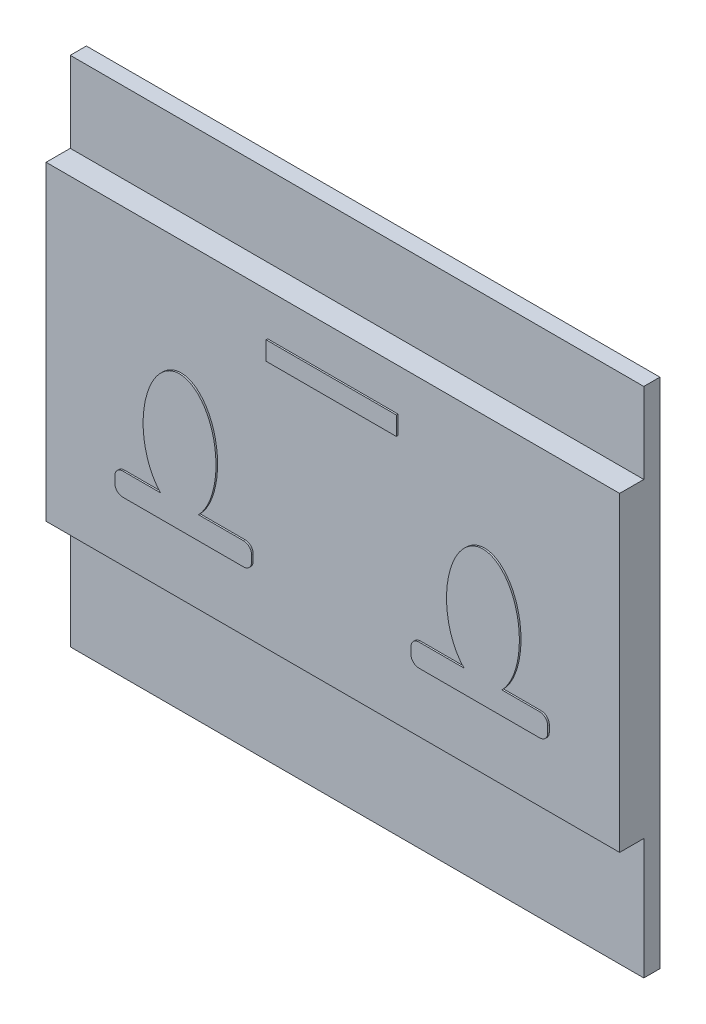
ISO-10303-21;
HEADER;
FILE_DESCRIPTION(('STEP AP214'),'2;1');
FILE_NAME('part.step','',(''),(''),'','','');
FILE_SCHEMA(('AUTOMOTIVE_DESIGN { 1 0 10303 214 1 1 1 1 }'));
ENDSEC;
DATA;
#1=APPLICATION_CONTEXT('core data for automotive mechanical design processes');
#2=APPLICATION_PROTOCOL_DEFINITION('international standard','automotive_design',2000,#1);
#3=PRODUCT_CONTEXT('',#1,'mechanical');
#4=PRODUCT('Part','Part','',(#3));
#5=PRODUCT_RELATED_PRODUCT_CATEGORY('part','',(#4));
#6=PRODUCT_DEFINITION_FORMATION('','',#4);
#7=PRODUCT_DEFINITION_CONTEXT('part definition',#1,'design');
#8=PRODUCT_DEFINITION('design','',#6,#7);
#9=PRODUCT_DEFINITION_SHAPE('','',#8);
#10=(LENGTH_UNIT() NAMED_UNIT(*) SI_UNIT(.MILLI.,.METRE.));
#11=(NAMED_UNIT(*) PLANE_ANGLE_UNIT() SI_UNIT($,.RADIAN.));
#12=(NAMED_UNIT(*) SI_UNIT($,.STERADIAN.) SOLID_ANGLE_UNIT());
#13=UNCERTAINTY_MEASURE_WITH_UNIT(LENGTH_MEASURE(1.E-05),#10,'distance_accuracy_value','');
#14=(GEOMETRIC_REPRESENTATION_CONTEXT(3) GLOBAL_UNCERTAINTY_ASSIGNED_CONTEXT((#13)) GLOBAL_UNIT_ASSIGNED_CONTEXT((#10,
#11,#12)) REPRESENTATION_CONTEXT('',''));
#15=CARTESIAN_POINT('',(0.,0.,0.));
#16=DIRECTION('',(0.,0.,1.));
#17=DIRECTION('',(1.,0.,0.));
#18=AXIS2_PLACEMENT_3D('',#15,#16,#17);
#19=CARTESIAN_POINT('',(0.,0.,2.5));
#20=DIRECTION('',(0.,0.,1.));
#21=DIRECTION('',(1.,0.,0.));
#22=AXIS2_PLACEMENT_3D('',#19,#20,#21);
#23=PLANE('',#22);
#24=DIRECTION('',(-1.,0.,0.));
#25=VECTOR('',#24,1.);
#26=CARTESIAN_POINT('',(-4.04139558605371,8.28616063797973,2.5));
#27=LINE('',#26,#25);
#28=CARTESIAN_POINT('',(4.04139558605371,8.28616063797973,2.5));
#29=VERTEX_POINT('',#28);
#30=CARTESIAN_POINT('',(-4.04139558605371,8.28616063797973,2.5));
#31=VERTEX_POINT('',#30);
#32=EDGE_CURVE('E276',#29,#31,#27,.T.);
#33=ORIENTED_EDGE('',*,*,#32,.F.);
#34=DIRECTION('',(0.,1.,0.));
#35=VECTOR('',#34,1.);
#36=CARTESIAN_POINT('',(4.04139558605371,8.28616063797973,2.5));
#37=LINE('',#36,#35);
#38=CARTESIAN_POINT('',(4.04139558605371,7.13085222622603,2.5));
#39=VERTEX_POINT('',#38);
#40=EDGE_CURVE('E273',#39,#29,#37,.T.);
#41=ORIENTED_EDGE('',*,*,#40,.F.);
#42=DIRECTION('',(1.,0.,0.));
#43=VECTOR('',#42,1.);
#44=CARTESIAN_POINT('',(-4.04139558605371,7.13085222622603,2.5));
#45=LINE('',#44,#43);
#46=CARTESIAN_POINT('',(-4.04139558605371,7.13085222622603,2.5));
#47=VERTEX_POINT('',#46);
#48=EDGE_CURVE('E286',#47,#39,#45,.T.);
#49=ORIENTED_EDGE('',*,*,#48,.F.);
#50=DIRECTION('',(0.,-1.,0.));
#51=VECTOR('',#50,1.);
#52=CARTESIAN_POINT('',(-4.04139558605371,8.28616063797973,2.5));
#53=LINE('',#52,#51);
#54=EDGE_CURVE('E294',#31,#47,#53,.T.);
#55=ORIENTED_EDGE('',*,*,#54,.F.);
#56=EDGE_LOOP('',(#33,#41,#49,#55));
#57=FACE_BOUND('',#56,.T.);
#58=DIRECTION('',(0.,1.,0.));
#59=VECTOR('',#58,1.);
#60=CARTESIAN_POINT('',(17.8,10.9,2.5));
#61=LINE('',#60,#59);
#62=CARTESIAN_POINT('',(17.8,-8.4,2.5));
#63=VERTEX_POINT('',#62);
#64=CARTESIAN_POINT('',(17.8,10.9,2.5));
#65=VERTEX_POINT('',#64);
#66=EDGE_CURVE('E456',#63,#65,#61,.T.);
#67=ORIENTED_EDGE('',*,*,#66,.T.);
#68=DIRECTION('',(-1.,0.,0.));
#69=VECTOR('',#68,1.);
#70=CARTESIAN_POINT('',(-17.8,10.9,2.5));
#71=LINE('',#70,#69);
#72=CARTESIAN_POINT('',(-17.8,10.9,2.5));
#73=VERTEX_POINT('',#72);
#74=EDGE_CURVE('E469',#65,#73,#71,.T.);
#75=ORIENTED_EDGE('',*,*,#74,.T.);
#76=DIRECTION('',(0.,-1.,0.));
#77=VECTOR('',#76,1.);
#78=CARTESIAN_POINT('',(-17.8,10.9,2.5));
#79=LINE('',#78,#77);
#80=CARTESIAN_POINT('',(-17.8,-8.4,2.5));
#81=VERTEX_POINT('',#80);
#82=EDGE_CURVE('E467',#73,#81,#79,.T.);
#83=ORIENTED_EDGE('',*,*,#82,.T.);
#84=DIRECTION('',(1.,0.,0.));
#85=VECTOR('',#84,1.);
#86=CARTESIAN_POINT('',(-17.8,-8.4,2.5));
#87=LINE('',#86,#85);
#88=EDGE_CURVE('E464',#81,#63,#87,.T.);
#89=ORIENTED_EDGE('',*,*,#88,.T.);
#90=EDGE_LOOP('',(#67,#75,#83,#89));
#91=FACE_BOUND('',#90,.T.);
#92=DIRECTION('',(1.,0.,0.));
#93=VECTOR('',#92,1.);
#94=CARTESIAN_POINT('',(12.9345552815516,-4.6231550932699,2.5));
#95=LINE('',#94,#93);
#96=CARTESIAN_POINT('',(5.44554999524602,-4.6231550932699,2.5));
#97=VERTEX_POINT('',#96);
#98=CARTESIAN_POINT('',(12.9345552815516,-4.6231550932699,2.5));
#99=VERTEX_POINT('',#98);
#100=EDGE_CURVE('E515',#97,#99,#95,.T.);
#101=ORIENTED_EDGE('',*,*,#100,.F.);
#102=CARTESIAN_POINT('',(5.44554999524602,-4.1231550932699,2.5));
#103=DIRECTION('',(0.,0.,1.));
#104=DIRECTION('',(1.,0.,0.));
#105=AXIS2_PLACEMENT_3D('',#102,#103,#104);
#106=CIRCLE('',#105,0.5);
#107=CARTESIAN_POINT('',(4.94554999524602,-4.12315509326989,2.5));
#108=VERTEX_POINT('',#107);
#109=EDGE_CURVE('E305',#108,#97,#106,.T.);
#110=ORIENTED_EDGE('',*,*,#109,.F.);
#111=DIRECTION('',(0.,-1.,0.));
#112=VECTOR('',#111,1.);
#113=CARTESIAN_POINT('',(4.94554999524602,-4.12315509326989,2.5));
#114=LINE('',#113,#112);
#115=CARTESIAN_POINT('',(4.94554999524602,-3.71669267897525,2.5));
#116=VERTEX_POINT('',#115);
#117=EDGE_CURVE('E310',#116,#108,#114,.T.);
#118=ORIENTED_EDGE('',*,*,#117,.F.);
#119=CARTESIAN_POINT('',(5.44554999524602,-3.71669267897525,2.5));
#120=DIRECTION('',(0.,0.,1.));
#121=DIRECTION('',(-1.,0.,0.));
#122=AXIS2_PLACEMENT_3D('',#119,#120,#121);
#123=CIRCLE('',#122,0.5);
#124=CARTESIAN_POINT('',(5.44554999524602,-3.21669267897525,2.5));
#125=VERTEX_POINT('',#124);
#126=EDGE_CURVE('E500',#125,#116,#123,.T.);
#127=ORIENTED_EDGE('',*,*,#126,.F.);
#128=DIRECTION('',(-1.,0.,0.));
#129=VECTOR('',#128,1.);
#130=CARTESIAN_POINT('',(8.23788008970894,-3.21669267897525,2.5));
#131=LINE('',#130,#129);
#132=CARTESIAN_POINT('',(8.23788008970894,-3.21669267897525,2.5));
#133=VERTEX_POINT('',#132);
#134=EDGE_CURVE('E503',#133,#125,#131,.T.);
#135=ORIENTED_EDGE('',*,*,#134,.F.);
#136=CARTESIAN_POINT('',(9.41609124069688,0.,2.5));
#137=DIRECTION('',(0.,0.,1.));
#138=DIRECTION('',(0.,-1.,0.));
#139=AXIS2_PLACEMENT_3D('',#136,#137,#138);
#140=ELLIPSE('',#139,3.76923148459659,2.26038602298075);
#141=CARTESIAN_POINT('',(10.5943023916848,-3.21669267897525,2.5));
#142=VERTEX_POINT('',#141);
#143=EDGE_CURVE('E505',#142,#133,#140,.T.);
#144=ORIENTED_EDGE('',*,*,#143,.F.);
#145=DIRECTION('',(-1.,0.,0.));
#146=VECTOR('',#145,1.);
#147=CARTESIAN_POINT('',(12.9345552815516,-3.21669267897525,2.5));
#148=LINE('',#147,#146);
#149=CARTESIAN_POINT('',(12.9345552815516,-3.21669267897525,2.5));
#150=VERTEX_POINT('',#149);
#151=EDGE_CURVE('E507',#150,#142,#148,.T.);
#152=ORIENTED_EDGE('',*,*,#151,.F.);
#153=CARTESIAN_POINT('',(12.9345552815516,-3.71669267897525,2.5));
#154=DIRECTION('',(0.,0.,1.));
#155=DIRECTION('',(-1.,0.,0.));
#156=AXIS2_PLACEMENT_3D('',#153,#154,#155);
#157=CIRCLE('',#156,0.5);
#158=CARTESIAN_POINT('',(13.4345552815516,-3.71669267897525,2.5));
#159=VERTEX_POINT('',#158);
#160=EDGE_CURVE('E509',#159,#150,#157,.T.);
#161=ORIENTED_EDGE('',*,*,#160,.F.);
#162=DIRECTION('',(0.,1.,0.));
#163=VECTOR('',#162,1.);
#164=CARTESIAN_POINT('',(13.4345552815516,-4.12315509326989,2.5));
#165=LINE('',#164,#163);
#166=CARTESIAN_POINT('',(13.4345552815516,-4.12315509326989,2.5));
#167=VERTEX_POINT('',#166);
#168=EDGE_CURVE('E511',#167,#159,#165,.T.);
#169=ORIENTED_EDGE('',*,*,#168,.F.);
#170=CARTESIAN_POINT('',(12.9345552815516,-4.1231550932699,2.5));
#171=DIRECTION('',(0.,0.,1.));
#172=DIRECTION('',(-1.,0.,0.));
#173=AXIS2_PLACEMENT_3D('',#170,#171,#172);
#174=CIRCLE('',#173,0.5);
#175=EDGE_CURVE('E513',#99,#167,#174,.T.);
#176=ORIENTED_EDGE('',*,*,#175,.F.);
#177=EDGE_LOOP('',(#101,#110,#118,#127,#135,#144,#152,#161,#169,#176));
#178=FACE_BOUND('',#177,.T.);
#179=DIRECTION('',(-1.,0.,0.));
#180=VECTOR('',#179,1.);
#181=CARTESIAN_POINT('',(-12.9345552815516,-3.21669267897525,2.5));
#182=LINE('',#181,#180);
#183=CARTESIAN_POINT('',(-10.5943023916848,-3.21669267897525,2.5));
#184=VERTEX_POINT('',#183);
#185=CARTESIAN_POINT('',(-12.9345552815516,-3.21669267897525,2.5));
#186=VERTEX_POINT('',#185);
#187=EDGE_CURVE('E559',#184,#186,#182,.T.);
#188=ORIENTED_EDGE('',*,*,#187,.F.);
#189=CARTESIAN_POINT('',(-9.41609124069688,0.,2.5));
#190=DIRECTION('',(0.,0.,1.));
#191=DIRECTION('',(0.,-1.,0.));
#192=AXIS2_PLACEMENT_3D('',#189,#190,#191);
#193=ELLIPSE('',#192,3.76923148459659,2.26038602298075);
#194=CARTESIAN_POINT('',(-8.23788008970894,-3.21669267897525,2.5));
#195=VERTEX_POINT('',#194);
#196=EDGE_CURVE('E271',#195,#184,#193,.T.);
#197=ORIENTED_EDGE('',*,*,#196,.F.);
#198=DIRECTION('',(-1.,0.,0.));
#199=VECTOR('',#198,1.);
#200=CARTESIAN_POINT('',(-8.23788008970894,-3.21669267897525,2.5));
#201=LINE('',#200,#199);
#202=CARTESIAN_POINT('',(-5.44554999524602,-3.21669267897525,2.5));
#203=VERTEX_POINT('',#202);
#204=EDGE_CURVE('E267',#203,#195,#201,.T.);
#205=ORIENTED_EDGE('',*,*,#204,.F.);
#206=CARTESIAN_POINT('',(-5.44554999524602,-3.71669267897525,2.5));
#207=DIRECTION('',(0.,0.,1.));
#208=DIRECTION('',(1.,0.,0.));
#209=AXIS2_PLACEMENT_3D('',#206,#207,#208);
#210=CIRCLE('',#209,0.5);
#211=CARTESIAN_POINT('',(-4.94554999524602,-3.71669267897525,2.5));
#212=VERTEX_POINT('',#211);
#213=EDGE_CURVE('E578',#212,#203,#210,.T.);
#214=ORIENTED_EDGE('',*,*,#213,.F.);
#215=DIRECTION('',(0.,1.,0.));
#216=VECTOR('',#215,1.);
#217=CARTESIAN_POINT('',(-4.94554999524602,-4.12315509326989,2.5));
#218=LINE('',#217,#216);
#219=CARTESIAN_POINT('',(-4.94554999524602,-4.12315509326989,2.5));
#220=VERTEX_POINT('',#219);
#221=EDGE_CURVE('E576',#220,#212,#218,.T.);
#222=ORIENTED_EDGE('',*,*,#221,.F.);
#223=CARTESIAN_POINT('',(-5.44554999524602,-4.1231550932699,2.5));
#224=DIRECTION('',(0.,0.,1.));
#225=DIRECTION('',(-1.,0.,0.));
#226=AXIS2_PLACEMENT_3D('',#223,#224,#225);
#227=CIRCLE('',#226,0.5);
#228=CARTESIAN_POINT('',(-5.44554999524602,-4.6231550932699,2.5));
#229=VERTEX_POINT('',#228);
#230=EDGE_CURVE('E574',#229,#220,#227,.T.);
#231=ORIENTED_EDGE('',*,*,#230,.F.);
#232=DIRECTION('',(1.,0.,0.));
#233=VECTOR('',#232,1.);
#234=CARTESIAN_POINT('',(-12.9345552815516,-4.6231550932699,2.5));
#235=LINE('',#234,#233);
#236=CARTESIAN_POINT('',(-12.9345552815516,-4.6231550932699,2.5));
#237=VERTEX_POINT('',#236);
#238=EDGE_CURVE('E572',#237,#229,#235,.T.);
#239=ORIENTED_EDGE('',*,*,#238,.F.);
#240=CARTESIAN_POINT('',(-12.9345552815516,-4.1231550932699,2.5));
#241=DIRECTION('',(0.,0.,1.));
#242=DIRECTION('',(1.,0.,0.));
#243=AXIS2_PLACEMENT_3D('',#240,#241,#242);
#244=CIRCLE('',#243,0.5);
#245=CARTESIAN_POINT('',(-13.4345552815516,-4.12315509326989,2.5));
#246=VERTEX_POINT('',#245);
#247=EDGE_CURVE('E570',#246,#237,#244,.T.);
#248=ORIENTED_EDGE('',*,*,#247,.F.);
#249=DIRECTION('',(0.,-1.,0.));
#250=VECTOR('',#249,1.);
#251=CARTESIAN_POINT('',(-13.4345552815516,-4.12315509326989,2.5));
#252=LINE('',#251,#250);
#253=CARTESIAN_POINT('',(-13.4345552815516,-3.71669267897525,2.5));
#254=VERTEX_POINT('',#253);
#255=EDGE_CURVE('E564',#254,#246,#252,.T.);
#256=ORIENTED_EDGE('',*,*,#255,.F.);
#257=CARTESIAN_POINT('',(-12.9345552815516,-3.71669267897525,2.5));
#258=DIRECTION('',(0.,0.,1.));
#259=DIRECTION('',(1.,0.,0.));
#260=AXIS2_PLACEMENT_3D('',#257,#258,#259);
#261=CIRCLE('',#260,0.5);
#262=EDGE_CURVE('E562',#186,#254,#261,.T.);
#263=ORIENTED_EDGE('',*,*,#262,.F.);
#264=EDGE_LOOP('',(#188,#197,#205,#214,#222,#231,#239,#248,#256,#263));
#265=FACE_BOUND('',#264,.T.);
#266=ADVANCED_FACE('F36',(#57,#91,#178,#265),#23,.T.);
#267=CARTESIAN_POINT('',(0.,0.,1.));
#268=DIRECTION('',(0.,0.,-1.));
#269=DIRECTION('',(-1.,0.,0.));
#270=AXIS2_PLACEMENT_3D('',#267,#268,#269);
#271=PLANE('',#270);
#272=DIRECTION('',(1.,0.,0.));
#273=VECTOR('',#272,1.);
#274=CARTESIAN_POINT('',(-17.8,-8.4,1.));
#275=LINE('',#274,#273);
#276=CARTESIAN_POINT('',(-17.8,-8.4,1.));
#277=VERTEX_POINT('',#276);
#278=CARTESIAN_POINT('',(17.8,-8.4,1.));
#279=VERTEX_POINT('',#278);
#280=EDGE_CURVE('E454',#277,#279,#275,.T.);
#281=ORIENTED_EDGE('',*,*,#280,.F.);
#282=DIRECTION('',(0.,-1.,0.));
#283=VECTOR('',#282,1.);
#284=CARTESIAN_POINT('',(-17.8,15.9,1.));
#285=LINE('',#284,#283);
#286=CARTESIAN_POINT('',(-17.8,-15.9,1.));
#287=VERTEX_POINT('',#286);
#288=EDGE_CURVE('E412',#277,#287,#285,.T.);
#289=ORIENTED_EDGE('',*,*,#288,.T.);
#290=DIRECTION('',(1.,0.,0.));
#291=VECTOR('',#290,1.);
#292=CARTESIAN_POINT('',(17.8,-15.9,1.));
#293=LINE('',#292,#291);
#294=CARTESIAN_POINT('',(17.8,-15.9,1.));
#295=VERTEX_POINT('',#294);
#296=EDGE_CURVE('E424',#287,#295,#293,.T.);
#297=ORIENTED_EDGE('',*,*,#296,.T.);
#298=DIRECTION('',(0.,1.,0.));
#299=VECTOR('',#298,1.);
#300=CARTESIAN_POINT('',(17.8,15.9,1.));
#301=LINE('',#300,#299);
#302=EDGE_CURVE('E406',#295,#279,#301,.T.);
#303=ORIENTED_EDGE('',*,*,#302,.T.);
#304=EDGE_LOOP('',(#281,#289,#297,#303));
#305=FACE_BOUND('',#304,.T.);
#306=ADVANCED_FACE('F360',(#305),#271,.F.);
#307=DIRECTION('',(-1.,0.,0.));
#308=VECTOR('',#307,1.);
#309=CARTESIAN_POINT('',(-17.8,10.9,1.));
#310=LINE('',#309,#308);
#311=CARTESIAN_POINT('',(17.8,10.9,1.));
#312=VERTEX_POINT('',#311);
#313=CARTESIAN_POINT('',(-17.8,10.9,1.));
#314=VERTEX_POINT('',#313);
#315=EDGE_CURVE('E445',#312,#314,#310,.T.);
#316=ORIENTED_EDGE('',*,*,#315,.F.);
#317=CARTESIAN_POINT('',(17.8,15.9,1.));
#318=VERTEX_POINT('',#317);
#319=EDGE_CURVE('E433',#312,#318,#301,.T.);
#320=ORIENTED_EDGE('',*,*,#319,.T.);
#321=DIRECTION('',(-1.,0.,0.));
#322=VECTOR('',#321,1.);
#323=CARTESIAN_POINT('',(17.8,15.9,1.));
#324=LINE('',#323,#322);
#325=CARTESIAN_POINT('',(-17.8,15.9,1.));
#326=VERTEX_POINT('',#325);
#327=EDGE_CURVE('E419',#318,#326,#324,.T.);
#328=ORIENTED_EDGE('',*,*,#327,.T.);
#329=EDGE_CURVE('E421',#326,#314,#285,.T.);
#330=ORIENTED_EDGE('',*,*,#329,.T.);
#331=EDGE_LOOP('',(#316,#320,#328,#330));
#332=FACE_BOUND('',#331,.T.);
#333=ADVANCED_FACE('F372',(#332),#271,.F.);
#334=CARTESIAN_POINT('',(-17.8,15.9,1.));
#335=DIRECTION('',(1.,0.,0.));
#336=DIRECTION('',(0.,1.,0.));
#337=AXIS2_PLACEMENT_3D('',#334,#335,#336);
#338=PLANE('',#337);
#339=DIRECTION('',(0.,-1.,0.));
#340=VECTOR('',#339,1.);
#341=CARTESIAN_POINT('',(-17.8,15.9,0.));
#342=LINE('',#341,#340);
#343=CARTESIAN_POINT('',(-17.8,15.9,0.));
#344=VERTEX_POINT('',#343);
#345=CARTESIAN_POINT('',(-17.8,-15.9,0.));
#346=VERTEX_POINT('',#345);
#347=EDGE_CURVE('E401',#344,#346,#342,.T.);
#348=ORIENTED_EDGE('',*,*,#347,.T.);
#349=DIRECTION('',(0.,0.,-1.));
#350=VECTOR('',#349,1.);
#351=CARTESIAN_POINT('',(-17.8,-15.9,1.));
#352=LINE('',#351,#350);
#353=EDGE_CURVE('E11',#287,#346,#352,.T.);
#354=ORIENTED_EDGE('',*,*,#353,.F.);
#355=ORIENTED_EDGE('',*,*,#288,.F.);
#356=DIRECTION('',(0.,0.,-1.));
#357=VECTOR('',#356,1.);
#358=CARTESIAN_POINT('',(-17.8,-8.4,2.5));
#359=LINE('',#358,#357);
#360=EDGE_CURVE('E939',#81,#277,#359,.T.);
#361=ORIENTED_EDGE('',*,*,#360,.F.);
#362=ORIENTED_EDGE('',*,*,#82,.F.);
#363=DIRECTION('',(0.,0.,-1.));
#364=VECTOR('',#363,1.);
#365=CARTESIAN_POINT('',(-17.8,10.9,2.5));
#366=LINE('',#365,#364);
#367=EDGE_CURVE('E452',#73,#314,#366,.T.);
#368=ORIENTED_EDGE('',*,*,#367,.T.);
#369=ORIENTED_EDGE('',*,*,#329,.F.);
#370=DIRECTION('',(0.,0.,-1.));
#371=VECTOR('',#370,1.);
#372=CARTESIAN_POINT('',(-17.8,15.9,1.));
#373=LINE('',#372,#371);
#374=EDGE_CURVE('E416',#326,#344,#373,.T.);
#375=ORIENTED_EDGE('',*,*,#374,.T.);
#376=EDGE_LOOP('',(#348,#354,#355,#361,#362,#368,#369,#375));
#377=FACE_BOUND('',#376,.T.);
#378=ADVANCED_FACE('F38',(#377),#338,.F.);
#379=CARTESIAN_POINT('',(17.8,-15.9,1.));
#380=DIRECTION('',(0.,1.,0.));
#381=DIRECTION('',(-1.,0.,0.));
#382=AXIS2_PLACEMENT_3D('',#379,#380,#381);
#383=PLANE('',#382);
#384=DIRECTION('',(1.,0.,0.));
#385=VECTOR('',#384,1.);
#386=CARTESIAN_POINT('',(17.8,-15.9,0.));
#387=LINE('',#386,#385);
#388=CARTESIAN_POINT('',(17.8,-15.9,0.));
#389=VERTEX_POINT('',#388);
#390=EDGE_CURVE('E392',#346,#389,#387,.T.);
#391=ORIENTED_EDGE('',*,*,#390,.T.);
#392=DIRECTION('',(0.,0.,-1.));
#393=VECTOR('',#392,1.);
#394=CARTESIAN_POINT('',(17.8,-15.9,1.));
#395=LINE('',#394,#393);
#396=EDGE_CURVE('E45',#295,#389,#395,.T.);
#397=ORIENTED_EDGE('',*,*,#396,.F.);
#398=ORIENTED_EDGE('',*,*,#296,.F.);
#399=ORIENTED_EDGE('',*,*,#353,.T.);
#400=EDGE_LOOP('',(#391,#397,#398,#399));
#401=FACE_BOUND('',#400,.T.);
#402=ADVANCED_FACE('F383',(#401),#383,.F.);
#403=CARTESIAN_POINT('',(17.8,15.9,1.));
#404=DIRECTION('',(-1.,0.,0.));
#405=DIRECTION('',(0.,-1.,0.));
#406=AXIS2_PLACEMENT_3D('',#403,#404,#405);
#407=PLANE('',#406);
#408=DIRECTION('',(0.,1.,0.));
#409=VECTOR('',#408,1.);
#410=CARTESIAN_POINT('',(17.8,15.9,0.));
#411=LINE('',#410,#409);
#412=CARTESIAN_POINT('',(17.8,15.9,0.));
#413=VERTEX_POINT('',#412);
#414=EDGE_CURVE('E400',#389,#413,#411,.T.);
#415=ORIENTED_EDGE('',*,*,#414,.T.);
#416=DIRECTION('',(0.,0.,-1.));
#417=VECTOR('',#416,1.);
#418=CARTESIAN_POINT('',(17.8,15.9,1.));
#419=LINE('',#418,#417);
#420=EDGE_CURVE('E407',#318,#413,#419,.T.);
#421=ORIENTED_EDGE('',*,*,#420,.F.);
#422=ORIENTED_EDGE('',*,*,#319,.F.);
#423=DIRECTION('',(0.,0.,-1.));
#424=VECTOR('',#423,1.);
#425=CARTESIAN_POINT('',(17.8,10.9,2.5));
#426=LINE('',#425,#424);
#427=EDGE_CURVE('E453',#65,#312,#426,.T.);
#428=ORIENTED_EDGE('',*,*,#427,.F.);
#429=ORIENTED_EDGE('',*,*,#66,.F.);
#430=DIRECTION('',(0.,0.,-1.));
#431=VECTOR('',#430,1.);
#432=CARTESIAN_POINT('',(17.8,-8.4,2.5));
#433=LINE('',#432,#431);
#434=EDGE_CURVE('E466',#63,#279,#433,.T.);
#435=ORIENTED_EDGE('',*,*,#434,.T.);
#436=ORIENTED_EDGE('',*,*,#302,.F.);
#437=ORIENTED_EDGE('',*,*,#396,.T.);
#438=EDGE_LOOP('',(#415,#421,#422,#428,#429,#435,#436,#437));
#439=FACE_BOUND('',#438,.T.);
#440=ADVANCED_FACE('F380',(#439),#407,.F.);
#441=CARTESIAN_POINT('',(17.8,15.9,1.));
#442=DIRECTION('',(0.,-1.,0.));
#443=DIRECTION('',(0.,0.,-1.));
#444=AXIS2_PLACEMENT_3D('',#441,#442,#443);
#445=PLANE('',#444);
#446=DIRECTION('',(-1.,0.,0.));
#447=VECTOR('',#446,1.);
#448=CARTESIAN_POINT('',(17.8,15.9,0.));
#449=LINE('',#448,#447);
#450=EDGE_CURVE('E410',#413,#344,#449,.T.);
#451=ORIENTED_EDGE('',*,*,#450,.T.);
#452=ORIENTED_EDGE('',*,*,#374,.F.);
#453=ORIENTED_EDGE('',*,*,#327,.F.);
#454=ORIENTED_EDGE('',*,*,#420,.T.);
#455=EDGE_LOOP('',(#451,#452,#453,#454));
#456=FACE_BOUND('',#455,.T.);
#457=ADVANCED_FACE('F376',(#456),#445,.F.);
#458=CARTESIAN_POINT('',(0.,0.,0.));
#459=DIRECTION('',(0.,0.,-1.));
#460=DIRECTION('',(-1.,0.,0.));
#461=AXIS2_PLACEMENT_3D('',#458,#459,#460);
#462=PLANE('',#461);
#463=ORIENTED_EDGE('',*,*,#347,.F.);
#464=ORIENTED_EDGE('',*,*,#450,.F.);
#465=ORIENTED_EDGE('',*,*,#414,.F.);
#466=ORIENTED_EDGE('',*,*,#390,.F.);
#467=EDGE_LOOP('',(#463,#464,#465,#466));
#468=FACE_BOUND('',#467,.T.);
#469=ADVANCED_FACE('F368',(#468),#462,.T.);
#470=CARTESIAN_POINT('',(-17.8,10.9,2.5));
#471=DIRECTION('',(0.,-1.,0.));
#472=DIRECTION('',(0.,0.,-1.));
#473=AXIS2_PLACEMENT_3D('',#470,#471,#472);
#474=PLANE('',#473);
#475=ORIENTED_EDGE('',*,*,#315,.T.);
#476=ORIENTED_EDGE('',*,*,#367,.F.);
#477=ORIENTED_EDGE('',*,*,#74,.F.);
#478=ORIENTED_EDGE('',*,*,#427,.T.);
#479=EDGE_LOOP('',(#475,#476,#477,#478));
#480=FACE_BOUND('',#479,.T.);
#481=ADVANCED_FACE('F364',(#480),#474,.F.);
#482=CARTESIAN_POINT('',(-17.8,-8.4,2.5));
#483=DIRECTION('',(0.,1.,0.));
#484=DIRECTION('',(0.,0.,1.));
#485=AXIS2_PLACEMENT_3D('',#482,#483,#484);
#486=PLANE('',#485);
#487=ORIENTED_EDGE('',*,*,#280,.T.);
#488=ORIENTED_EDGE('',*,*,#434,.F.);
#489=ORIENTED_EDGE('',*,*,#88,.F.);
#490=ORIENTED_EDGE('',*,*,#360,.T.);
#491=EDGE_LOOP('',(#487,#488,#489,#490));
#492=FACE_BOUND('',#491,.T.);
#493=ADVANCED_FACE('F356',(#492),#486,.F.);
#494=CARTESIAN_POINT('',(5.44554999524602,-4.1231550932699,2.6));
#495=DIRECTION('',(0.,0.,-1.));
#496=DIRECTION('',(-1.,0.,0.));
#497=AXIS2_PLACEMENT_3D('',#494,#495,#496);
#498=CYLINDRICAL_SURFACE('',#497,0.5);
#499=ORIENTED_EDGE('',*,*,#109,.T.);
#500=DIRECTION('',(0.,0.,-1.));
#501=VECTOR('',#500,1.);
#502=CARTESIAN_POINT('',(5.44554999524602,-4.6231550932699,2.6));
#503=LINE('',#502,#501);
#504=CARTESIAN_POINT('',(5.44554999524602,-4.6231550932699,2.6));
#505=VERTEX_POINT('',#504);
#506=EDGE_CURVE('E455',#505,#97,#503,.T.);
#507=ORIENTED_EDGE('',*,*,#506,.F.);
#508=CARTESIAN_POINT('',(5.44554999524602,-4.1231550932699,2.6));
#509=DIRECTION('',(0.,0.,1.));
#510=DIRECTION('',(1.,0.,0.));
#511=AXIS2_PLACEMENT_3D('',#508,#509,#510);
#512=CIRCLE('',#511,0.5);
#513=CARTESIAN_POINT('',(4.94554999524602,-4.12315509326989,2.6));
#514=VERTEX_POINT('',#513);
#515=EDGE_CURVE('E306',#514,#505,#512,.T.);
#516=ORIENTED_EDGE('',*,*,#515,.F.);
#517=DIRECTION('',(0.,0.,-1.));
#518=VECTOR('',#517,1.);
#519=CARTESIAN_POINT('',(4.94554999524602,-4.12315509326989,2.6));
#520=LINE('',#519,#518);
#521=EDGE_CURVE('E495',#514,#108,#520,.T.);
#522=ORIENTED_EDGE('',*,*,#521,.T.);
#523=EDGE_LOOP('',(#499,#507,#516,#522));
#524=FACE_BOUND('',#523,.T.);
#525=ADVANCED_FACE('F352',(#524),#498,.T.);
#526=CARTESIAN_POINT('',(12.9345552815516,-4.6231550932699,2.6));
#527=DIRECTION('',(0.,1.,0.));
#528=DIRECTION('',(0.,0.,1.));
#529=AXIS2_PLACEMENT_3D('',#526,#527,#528);
#530=PLANE('',#529);
#531=ORIENTED_EDGE('',*,*,#100,.T.);
#532=DIRECTION('',(0.,0.,-1.));
#533=VECTOR('',#532,1.);
#534=CARTESIAN_POINT('',(12.9345552815516,-4.6231550932699,2.6));
#535=LINE('',#534,#533);
#536=CARTESIAN_POINT('',(12.9345552815516,-4.6231550932699,2.6));
#537=VERTEX_POINT('',#536);
#538=EDGE_CURVE('E458',#537,#99,#535,.T.);
#539=ORIENTED_EDGE('',*,*,#538,.F.);
#540=DIRECTION('',(1.,0.,0.));
#541=VECTOR('',#540,1.);
#542=CARTESIAN_POINT('',(12.9345552815516,-4.6231550932699,2.6));
#543=LINE('',#542,#541);
#544=EDGE_CURVE('E309',#505,#537,#543,.T.);
#545=ORIENTED_EDGE('',*,*,#544,.F.);
#546=ORIENTED_EDGE('',*,*,#506,.T.);
#547=EDGE_LOOP('',(#531,#539,#545,#546));
#548=FACE_BOUND('',#547,.T.);
#549=ADVANCED_FACE('F348',(#548),#530,.F.);
#550=CARTESIAN_POINT('',(12.9345552815516,-4.1231550932699,2.6));
#551=DIRECTION('',(0.,0.,-1.));
#552=DIRECTION('',(-1.,0.,0.));
#553=AXIS2_PLACEMENT_3D('',#550,#551,#552);
#554=CYLINDRICAL_SURFACE('',#553,0.5);
#555=ORIENTED_EDGE('',*,*,#175,.T.);
#556=DIRECTION('',(0.,0.,-1.));
#557=VECTOR('',#556,1.);
#558=CARTESIAN_POINT('',(13.4345552815516,-4.12315509326989,2.6));
#559=LINE('',#558,#557);
#560=CARTESIAN_POINT('',(13.4345552815516,-4.12315509326989,2.6));
#561=VERTEX_POINT('',#560);
#562=EDGE_CURVE('E475',#561,#167,#559,.T.);
#563=ORIENTED_EDGE('',*,*,#562,.F.);
#564=CARTESIAN_POINT('',(12.9345552815516,-4.1231550932699,2.6));
#565=DIRECTION('',(0.,0.,1.));
#566=DIRECTION('',(-1.,0.,0.));
#567=AXIS2_PLACEMENT_3D('',#564,#565,#566);
#568=CIRCLE('',#567,0.5);
#569=EDGE_CURVE('E312',#537,#561,#568,.T.);
#570=ORIENTED_EDGE('',*,*,#569,.F.);
#571=ORIENTED_EDGE('',*,*,#538,.T.);
#572=EDGE_LOOP('',(#555,#563,#570,#571));
#573=FACE_BOUND('',#572,.T.);
#574=ADVANCED_FACE('F344',(#573),#554,.T.);
#575=CARTESIAN_POINT('',(13.4345552815516,-4.12315509326989,2.6));
#576=DIRECTION('',(-1.,0.,0.));
#577=DIRECTION('',(0.,0.,1.));
#578=AXIS2_PLACEMENT_3D('',#575,#576,#577);
#579=PLANE('',#578);
#580=ORIENTED_EDGE('',*,*,#168,.T.);
#581=DIRECTION('',(0.,0.,-1.));
#582=VECTOR('',#581,1.);
#583=CARTESIAN_POINT('',(13.4345552815516,-3.71669267897525,2.6));
#584=LINE('',#583,#582);
#585=CARTESIAN_POINT('',(13.4345552815516,-3.71669267897525,2.6));
#586=VERTEX_POINT('',#585);
#587=EDGE_CURVE('E478',#586,#159,#584,.T.);
#588=ORIENTED_EDGE('',*,*,#587,.F.);
#589=DIRECTION('',(0.,1.,0.));
#590=VECTOR('',#589,1.);
#591=CARTESIAN_POINT('',(13.4345552815516,-4.12315509326989,2.6));
#592=LINE('',#591,#590);
#593=EDGE_CURVE('E314',#561,#586,#592,.T.);
#594=ORIENTED_EDGE('',*,*,#593,.F.);
#595=ORIENTED_EDGE('',*,*,#562,.T.);
#596=EDGE_LOOP('',(#580,#588,#594,#595));
#597=FACE_BOUND('',#596,.T.);
#598=ADVANCED_FACE('F340',(#597),#579,.F.);
#599=CARTESIAN_POINT('',(12.9345552815516,-3.71669267897525,2.6));
#600=DIRECTION('',(0.,0.,-1.));
#601=DIRECTION('',(-1.,0.,0.));
#602=AXIS2_PLACEMENT_3D('',#599,#600,#601);
#603=CYLINDRICAL_SURFACE('',#602,0.5);
#604=ORIENTED_EDGE('',*,*,#160,.T.);
#605=DIRECTION('',(0.,0.,-1.));
#606=VECTOR('',#605,1.);
#607=CARTESIAN_POINT('',(12.9345552815516,-3.21669267897525,2.6));
#608=LINE('',#607,#606);
#609=CARTESIAN_POINT('',(12.9345552815516,-3.21669267897525,2.6));
#610=VERTEX_POINT('',#609);
#611=EDGE_CURVE('E481',#610,#150,#608,.T.);
#612=ORIENTED_EDGE('',*,*,#611,.F.);
#613=CARTESIAN_POINT('',(12.9345552815516,-3.71669267897525,2.6));
#614=DIRECTION('',(0.,0.,1.));
#615=DIRECTION('',(-1.,0.,0.));
#616=AXIS2_PLACEMENT_3D('',#613,#614,#615);
#617=CIRCLE('',#616,0.5);
#618=EDGE_CURVE('E316',#586,#610,#617,.T.);
#619=ORIENTED_EDGE('',*,*,#618,.F.);
#620=ORIENTED_EDGE('',*,*,#587,.T.);
#621=EDGE_LOOP('',(#604,#612,#619,#620));
#622=FACE_BOUND('',#621,.T.);
#623=ADVANCED_FACE('F336',(#622),#603,.T.);
#624=CARTESIAN_POINT('',(12.9345552815516,-3.21669267897525,2.6));
#625=DIRECTION('',(0.,-1.,0.));
#626=DIRECTION('',(0.,0.,-1.));
#627=AXIS2_PLACEMENT_3D('',#624,#625,#626);
#628=PLANE('',#627);
#629=ORIENTED_EDGE('',*,*,#151,.T.);
#630=DIRECTION('',(0.,0.,-1.));
#631=VECTOR('',#630,1.);
#632=CARTESIAN_POINT('',(10.5943023916848,-3.21669267897525,2.6));
#633=LINE('',#632,#631);
#634=CARTESIAN_POINT('',(10.5943023916848,-3.21669267897525,2.6));
#635=VERTEX_POINT('',#634);
#636=EDGE_CURVE('E484',#635,#142,#633,.T.);
#637=ORIENTED_EDGE('',*,*,#636,.F.);
#638=DIRECTION('',(-1.,0.,0.));
#639=VECTOR('',#638,1.);
#640=CARTESIAN_POINT('',(12.9345552815516,-3.21669267897525,2.6));
#641=LINE('',#640,#639);
#642=EDGE_CURVE('E318',#610,#635,#641,.T.);
#643=ORIENTED_EDGE('',*,*,#642,.F.);
#644=ORIENTED_EDGE('',*,*,#611,.T.);
#645=EDGE_LOOP('',(#629,#637,#643,#644));
#646=FACE_BOUND('',#645,.T.);
#647=ADVANCED_FACE('F331',(#646),#628,.F.);
#648=CARTESIAN_POINT('',(9.41609124069688,0.,2.6));
#649=DIRECTION('',(0.,0.,1.));
#650=DIRECTION('',(0.,-1.,0.));
#651=AXIS2_PLACEMENT_3D('',#648,#649,#650);
#652=ELLIPSE('',#651,3.76923148459659,2.26038602298075);
#653=DIRECTION('',(0.,0.,-1.));
#654=VECTOR('',#653,1.);
#655=SURFACE_OF_LINEAR_EXTRUSION('',#652,#654);
#656=ORIENTED_EDGE('',*,*,#143,.T.);
#657=DIRECTION('',(0.,0.,-1.));
#658=VECTOR('',#657,1.);
#659=CARTESIAN_POINT('',(8.23788008970894,-3.21669267897525,2.6));
#660=LINE('',#659,#658);
#661=CARTESIAN_POINT('',(8.23788008970894,-3.21669267897525,2.6));
#662=VERTEX_POINT('',#661);
#663=EDGE_CURVE('E487',#662,#133,#660,.T.);
#664=ORIENTED_EDGE('',*,*,#663,.F.);
#665=EDGE_CURVE('E320',#635,#662,#652,.T.);
#666=ORIENTED_EDGE('',*,*,#665,.F.);
#667=ORIENTED_EDGE('',*,*,#636,.T.);
#668=EDGE_LOOP('',(#656,#664,#666,#667));
#669=FACE_BOUND('',#668,.T.);
#670=ADVANCED_FACE('F326',(#669),#655,.F.);
#671=CARTESIAN_POINT('',(8.23788008970894,-3.21669267897525,2.6));
#672=DIRECTION('',(0.,-1.,0.));
#673=DIRECTION('',(0.,0.,-1.));
#674=AXIS2_PLACEMENT_3D('',#671,#672,#673);
#675=PLANE('',#674);
#676=ORIENTED_EDGE('',*,*,#134,.T.);
#677=DIRECTION('',(0.,0.,-1.));
#678=VECTOR('',#677,1.);
#679=CARTESIAN_POINT('',(5.44554999524602,-3.21669267897525,2.6));
#680=LINE('',#679,#678);
#681=CARTESIAN_POINT('',(5.44554999524602,-3.21669267897525,2.6));
#682=VERTEX_POINT('',#681);
#683=EDGE_CURVE('E490',#682,#125,#680,.T.);
#684=ORIENTED_EDGE('',*,*,#683,.F.);
#685=DIRECTION('',(-1.,0.,0.));
#686=VECTOR('',#685,1.);
#687=CARTESIAN_POINT('',(8.23788008970894,-3.21669267897525,2.6));
#688=LINE('',#687,#686);
#689=EDGE_CURVE('E323',#662,#682,#688,.T.);
#690=ORIENTED_EDGE('',*,*,#689,.F.);
#691=ORIENTED_EDGE('',*,*,#663,.T.);
#692=EDGE_LOOP('',(#676,#684,#690,#691));
#693=FACE_BOUND('',#692,.T.);
#694=ADVANCED_FACE('F330',(#693),#675,.F.);
#695=CARTESIAN_POINT('',(5.44554999524602,-3.71669267897525,2.6));
#696=DIRECTION('',(0.,0.,-1.));
#697=DIRECTION('',(-1.,0.,0.));
#698=AXIS2_PLACEMENT_3D('',#695,#696,#697);
#699=CYLINDRICAL_SURFACE('',#698,0.5);
#700=ORIENTED_EDGE('',*,*,#126,.T.);
#701=DIRECTION('',(0.,0.,-1.));
#702=VECTOR('',#701,1.);
#703=CARTESIAN_POINT('',(4.94554999524602,-3.71669267897525,2.6));
#704=LINE('',#703,#702);
#705=CARTESIAN_POINT('',(4.94554999524602,-3.71669267897525,2.6));
#706=VERTEX_POINT('',#705);
#707=EDGE_CURVE('E493',#706,#116,#704,.T.);
#708=ORIENTED_EDGE('',*,*,#707,.F.);
#709=CARTESIAN_POINT('',(5.44554999524602,-3.71669267897525,2.6));
#710=DIRECTION('',(0.,0.,1.));
#711=DIRECTION('',(-1.,0.,0.));
#712=AXIS2_PLACEMENT_3D('',#709,#710,#711);
#713=CIRCLE('',#712,0.5);
#714=EDGE_CURVE('E519',#682,#706,#713,.T.);
#715=ORIENTED_EDGE('',*,*,#714,.F.);
#716=ORIENTED_EDGE('',*,*,#683,.T.);
#717=EDGE_LOOP('',(#700,#708,#715,#716));
#718=FACE_BOUND('',#717,.T.);
#719=ADVANCED_FACE('F532',(#718),#699,.T.);
#720=CARTESIAN_POINT('',(4.94554999524602,-4.12315509326989,2.6));
#721=DIRECTION('',(1.,0.,0.));
#722=DIRECTION('',(0.,0.,-1.));
#723=AXIS2_PLACEMENT_3D('',#720,#721,#722);
#724=PLANE('',#723);
#725=ORIENTED_EDGE('',*,*,#117,.T.);
#726=ORIENTED_EDGE('',*,*,#521,.F.);
#727=DIRECTION('',(0.,-1.,0.));
#728=VECTOR('',#727,1.);
#729=CARTESIAN_POINT('',(4.94554999524602,-4.12315509326989,2.6));
#730=LINE('',#729,#728);
#731=EDGE_CURVE('E498',#706,#514,#730,.T.);
#732=ORIENTED_EDGE('',*,*,#731,.F.);
#733=ORIENTED_EDGE('',*,*,#707,.T.);
#734=EDGE_LOOP('',(#725,#726,#732,#733));
#735=FACE_BOUND('',#734,.T.);
#736=ADVANCED_FACE('F537',(#735),#724,.F.);
#737=CARTESIAN_POINT('',(9.41609124069688,0.,2.6));
#738=DIRECTION('',(0.,0.,1.));
#739=DIRECTION('',(1.,0.,0.));
#740=AXIS2_PLACEMENT_3D('',#737,#738,#739);
#741=PLANE('',#740);
#742=ORIENTED_EDGE('',*,*,#515,.T.);
#743=ORIENTED_EDGE('',*,*,#544,.T.);
#744=ORIENTED_EDGE('',*,*,#569,.T.);
#745=ORIENTED_EDGE('',*,*,#593,.T.);
#746=ORIENTED_EDGE('',*,*,#618,.T.);
#747=ORIENTED_EDGE('',*,*,#642,.T.);
#748=ORIENTED_EDGE('',*,*,#665,.T.);
#749=ORIENTED_EDGE('',*,*,#689,.T.);
#750=ORIENTED_EDGE('',*,*,#714,.T.);
#751=ORIENTED_EDGE('',*,*,#731,.T.);
#752=EDGE_LOOP('',(#742,#743,#744,#745,#746,#747,#748,#749,#750,#751));
#753=FACE_BOUND('',#752,.T.);
#754=ADVANCED_FACE('F525',(#753),#741,.T.);
#755=CARTESIAN_POINT('',(4.04139558605371,8.28616063797973,2.6));
#756=DIRECTION('',(-1.,0.,0.));
#757=DIRECTION('',(0.,0.,1.));
#758=AXIS2_PLACEMENT_3D('',#755,#756,#757);
#759=PLANE('',#758);
#760=ORIENTED_EDGE('',*,*,#40,.T.);
#761=DIRECTION('',(0.,0.,-1.));
#762=VECTOR('',#761,1.);
#763=CARTESIAN_POINT('',(4.04139558605371,8.28616063797973,2.6));
#764=LINE('',#763,#762);
#765=CARTESIAN_POINT('',(4.04139558605371,8.28616063797973,2.6));
#766=VERTEX_POINT('',#765);
#767=EDGE_CURVE('E303',#766,#29,#764,.T.);
#768=ORIENTED_EDGE('',*,*,#767,.F.);
#769=DIRECTION('',(0.,1.,0.));
#770=VECTOR('',#769,1.);
#771=CARTESIAN_POINT('',(4.04139558605371,8.28616063797973,2.6));
#772=LINE('',#771,#770);
#773=CARTESIAN_POINT('',(4.04139558605371,7.13085222622603,2.6));
#774=VERTEX_POINT('',#773);
#775=EDGE_CURVE('E282',#774,#766,#772,.T.);
#776=ORIENTED_EDGE('',*,*,#775,.F.);
#777=DIRECTION('',(0.,0.,-1.));
#778=VECTOR('',#777,1.);
#779=CARTESIAN_POINT('',(4.04139558605371,7.13085222622603,2.6));
#780=LINE('',#779,#778);
#781=EDGE_CURVE('E291',#774,#39,#780,.T.);
#782=ORIENTED_EDGE('',*,*,#781,.T.);
#783=EDGE_LOOP('',(#760,#768,#776,#782));
#784=FACE_BOUND('',#783,.T.);
#785=ADVANCED_FACE('F679',(#784),#759,.F.);
#786=CARTESIAN_POINT('',(-4.04139558605371,8.28616063797973,2.6));
#787=DIRECTION('',(0.,-1.,0.));
#788=DIRECTION('',(0.,0.,-1.));
#789=AXIS2_PLACEMENT_3D('',#786,#787,#788);
#790=PLANE('',#789);
#791=ORIENTED_EDGE('',*,*,#32,.T.);
#792=DIRECTION('',(0.,0.,-1.));
#793=VECTOR('',#792,1.);
#794=CARTESIAN_POINT('',(-4.04139558605371,8.28616063797973,2.6));
#795=LINE('',#794,#793);
#796=CARTESIAN_POINT('',(-4.04139558605371,8.28616063797973,2.6));
#797=VERTEX_POINT('',#796);
#798=EDGE_CURVE('E300',#797,#31,#795,.T.);
#799=ORIENTED_EDGE('',*,*,#798,.F.);
#800=DIRECTION('',(-1.,0.,0.));
#801=VECTOR('',#800,1.);
#802=CARTESIAN_POINT('',(-4.04139558605371,8.28616063797973,2.6));
#803=LINE('',#802,#801);
#804=EDGE_CURVE('E285',#766,#797,#803,.T.);
#805=ORIENTED_EDGE('',*,*,#804,.F.);
#806=ORIENTED_EDGE('',*,*,#767,.T.);
#807=EDGE_LOOP('',(#791,#799,#805,#806));
#808=FACE_BOUND('',#807,.T.);
#809=ADVANCED_FACE('F675',(#808),#790,.F.);
#810=CARTESIAN_POINT('',(-4.04139558605371,8.28616063797973,2.6));
#811=DIRECTION('',(1.,0.,0.));
#812=DIRECTION('',(0.,0.,-1.));
#813=AXIS2_PLACEMENT_3D('',#810,#811,#812);
#814=PLANE('',#813);
#815=ORIENTED_EDGE('',*,*,#54,.T.);
#816=DIRECTION('',(0.,0.,-1.));
#817=VECTOR('',#816,1.);
#818=CARTESIAN_POINT('',(-4.04139558605371,7.13085222622603,2.6));
#819=LINE('',#818,#817);
#820=CARTESIAN_POINT('',(-4.04139558605371,7.13085222622603,2.6));
#821=VERTEX_POINT('',#820);
#822=EDGE_CURVE('E61',#821,#47,#819,.T.);
#823=ORIENTED_EDGE('',*,*,#822,.F.);
#824=DIRECTION('',(0.,-1.,0.));
#825=VECTOR('',#824,1.);
#826=CARTESIAN_POINT('',(-4.04139558605371,8.28616063797973,2.6));
#827=LINE('',#826,#825);
#828=EDGE_CURVE('E288',#797,#821,#827,.T.);
#829=ORIENTED_EDGE('',*,*,#828,.F.);
#830=ORIENTED_EDGE('',*,*,#798,.T.);
#831=EDGE_LOOP('',(#815,#823,#829,#830));
#832=FACE_BOUND('',#831,.T.);
#833=ADVANCED_FACE('F672',(#832),#814,.F.);
#834=CARTESIAN_POINT('',(-4.04139558605371,7.13085222622603,2.6));
#835=DIRECTION('',(0.,1.,0.));
#836=DIRECTION('',(0.,0.,1.));
#837=AXIS2_PLACEMENT_3D('',#834,#835,#836);
#838=PLANE('',#837);
#839=ORIENTED_EDGE('',*,*,#48,.T.);
#840=ORIENTED_EDGE('',*,*,#781,.F.);
#841=DIRECTION('',(1.,0.,0.));
#842=VECTOR('',#841,1.);
#843=CARTESIAN_POINT('',(-4.04139558605371,7.13085222622603,2.6));
#844=LINE('',#843,#842);
#845=EDGE_CURVE('E290',#821,#774,#844,.T.);
#846=ORIENTED_EDGE('',*,*,#845,.F.);
#847=ORIENTED_EDGE('',*,*,#822,.T.);
#848=EDGE_LOOP('',(#839,#840,#846,#847));
#849=FACE_BOUND('',#848,.T.);
#850=ADVANCED_FACE('F668',(#849),#838,.F.);
#851=CARTESIAN_POINT('',(0.,0.,2.6));
#852=DIRECTION('',(0.,0.,1.));
#853=DIRECTION('',(1.,0.,0.));
#854=AXIS2_PLACEMENT_3D('',#851,#852,#853);
#855=PLANE('',#854);
#856=ORIENTED_EDGE('',*,*,#775,.T.);
#857=ORIENTED_EDGE('',*,*,#804,.T.);
#858=ORIENTED_EDGE('',*,*,#828,.T.);
#859=ORIENTED_EDGE('',*,*,#845,.T.);
#860=EDGE_LOOP('',(#856,#857,#858,#859));
#861=FACE_BOUND('',#860,.T.);
#862=ADVANCED_FACE('F663',(#861),#855,.T.);
#863=CARTESIAN_POINT('',(-9.41609124069688,0.,2.6));
#864=DIRECTION('',(0.,0.,1.));
#865=DIRECTION('',(0.,-1.,0.));
#866=AXIS2_PLACEMENT_3D('',#863,#864,#865);
#867=ELLIPSE('',#866,3.76923148459659,2.26038602298075);
#868=DIRECTION('',(0.,0.,-1.));
#869=VECTOR('',#868,1.);
#870=SURFACE_OF_LINEAR_EXTRUSION('',#867,#869);
#871=ORIENTED_EDGE('',*,*,#196,.T.);
#872=DIRECTION('',(0.,0.,-1.));
#873=VECTOR('',#872,1.);
#874=CARTESIAN_POINT('',(-10.5943023916848,-3.21669267897525,2.6));
#875=LINE('',#874,#873);
#876=CARTESIAN_POINT('',(-10.5943023916848,-3.21669267897525,2.6));
#877=VERTEX_POINT('',#876);
#878=EDGE_CURVE('E252',#877,#184,#875,.T.);
#879=ORIENTED_EDGE('',*,*,#878,.F.);
#880=CARTESIAN_POINT('',(-8.23788008970894,-3.21669267897525,2.6));
#881=VERTEX_POINT('',#880);
#882=EDGE_CURVE('E259',#881,#877,#867,.T.);
#883=ORIENTED_EDGE('',*,*,#882,.F.);
#884=DIRECTION('',(0.,0.,-1.));
#885=VECTOR('',#884,1.);
#886=CARTESIAN_POINT('',(-8.23788008970894,-3.21669267897525,2.6));
#887=LINE('',#886,#885);
#888=EDGE_CURVE('E581',#881,#195,#887,.T.);
#889=ORIENTED_EDGE('',*,*,#888,.T.);
#890=EDGE_LOOP('',(#871,#879,#883,#889));
#891=FACE_BOUND('',#890,.T.);
#892=ADVANCED_FACE('F269',(#891),#870,.F.);
#893=CARTESIAN_POINT('',(-12.9345552815516,-3.21669267897525,2.6));
#894=DIRECTION('',(0.,-1.,0.));
#895=DIRECTION('',(0.,0.,-1.));
#896=AXIS2_PLACEMENT_3D('',#893,#894,#895);
#897=PLANE('',#896);
#898=ORIENTED_EDGE('',*,*,#187,.T.);
#899=DIRECTION('',(0.,0.,-1.));
#900=VECTOR('',#899,1.);
#901=CARTESIAN_POINT('',(-12.9345552815516,-3.21669267897525,2.6));
#902=LINE('',#901,#900);
#903=CARTESIAN_POINT('',(-12.9345552815516,-3.21669267897525,2.6));
#904=VERTEX_POINT('',#903);
#905=EDGE_CURVE('E255',#904,#186,#902,.T.);
#906=ORIENTED_EDGE('',*,*,#905,.F.);
#907=DIRECTION('',(-1.,0.,0.));
#908=VECTOR('',#907,1.);
#909=CARTESIAN_POINT('',(-12.9345552815516,-3.21669267897525,2.6));
#910=LINE('',#909,#908);
#911=EDGE_CURVE('E248',#877,#904,#910,.T.);
#912=ORIENTED_EDGE('',*,*,#911,.F.);
#913=ORIENTED_EDGE('',*,*,#878,.T.);
#914=EDGE_LOOP('',(#898,#906,#912,#913));
#915=FACE_BOUND('',#914,.T.);
#916=ADVANCED_FACE('F250',(#915),#897,.F.);
#917=CARTESIAN_POINT('',(-12.9345552815516,-3.71669267897525,2.6));
#918=DIRECTION('',(0.,0.,-1.));
#919=DIRECTION('',(-1.,0.,0.));
#920=AXIS2_PLACEMENT_3D('',#917,#918,#919);
#921=CYLINDRICAL_SURFACE('',#920,0.5);
#922=ORIENTED_EDGE('',*,*,#262,.T.);
#923=DIRECTION('',(0.,0.,-1.));
#924=VECTOR('',#923,1.);
#925=CARTESIAN_POINT('',(-13.4345552815516,-3.71669267897525,2.6));
#926=LINE('',#925,#924);
#927=CARTESIAN_POINT('',(-13.4345552815516,-3.71669267897525,2.6));
#928=VERTEX_POINT('',#927);
#929=EDGE_CURVE('E278',#928,#254,#926,.T.);
#930=ORIENTED_EDGE('',*,*,#929,.F.);
#931=CARTESIAN_POINT('',(-12.9345552815516,-3.71669267897525,2.6));
#932=DIRECTION('',(0.,0.,1.));
#933=DIRECTION('',(1.,0.,0.));
#934=AXIS2_PLACEMENT_3D('',#931,#932,#933);
#935=CIRCLE('',#934,0.5);
#936=EDGE_CURVE('E258',#904,#928,#935,.T.);
#937=ORIENTED_EDGE('',*,*,#936,.F.);
#938=ORIENTED_EDGE('',*,*,#905,.T.);
#939=EDGE_LOOP('',(#922,#930,#937,#938));
#940=FACE_BOUND('',#939,.T.);
#941=ADVANCED_FACE('F656',(#940),#921,.T.);
#942=CARTESIAN_POINT('',(-13.4345552815516,-4.12315509326989,2.6));
#943=DIRECTION('',(1.,0.,0.));
#944=DIRECTION('',(0.,0.,-1.));
#945=AXIS2_PLACEMENT_3D('',#942,#943,#944);
#946=PLANE('',#945);
#947=ORIENTED_EDGE('',*,*,#255,.T.);
#948=DIRECTION('',(0.,0.,-1.));
#949=VECTOR('',#948,1.);
#950=CARTESIAN_POINT('',(-13.4345552815516,-4.12315509326989,2.6));
#951=LINE('',#950,#949);
#952=CARTESIAN_POINT('',(-13.4345552815516,-4.12315509326989,2.6));
#953=VERTEX_POINT('',#952);
#954=EDGE_CURVE('E596',#953,#246,#951,.T.);
#955=ORIENTED_EDGE('',*,*,#954,.F.);
#956=DIRECTION('',(0.,-1.,0.));
#957=VECTOR('',#956,1.);
#958=CARTESIAN_POINT('',(-13.4345552815516,-4.12315509326989,2.6));
#959=LINE('',#958,#957);
#960=EDGE_CURVE('E604',#928,#953,#959,.T.);
#961=ORIENTED_EDGE('',*,*,#960,.F.);
#962=ORIENTED_EDGE('',*,*,#929,.T.);
#963=EDGE_LOOP('',(#947,#955,#961,#962));
#964=FACE_BOUND('',#963,.T.);
#965=ADVANCED_FACE('F602',(#964),#946,.F.);
#966=CARTESIAN_POINT('',(-12.9345552815516,-4.1231550932699,2.6));
#967=DIRECTION('',(0.,0.,-1.));
#968=DIRECTION('',(-1.,0.,0.));
#969=AXIS2_PLACEMENT_3D('',#966,#967,#968);
#970=CYLINDRICAL_SURFACE('',#969,0.5);
#971=ORIENTED_EDGE('',*,*,#247,.T.);
#972=DIRECTION('',(0.,0.,-1.));
#973=VECTOR('',#972,1.);
#974=CARTESIAN_POINT('',(-12.9345552815516,-4.6231550932699,2.6));
#975=LINE('',#974,#973);
#976=CARTESIAN_POINT('',(-12.9345552815516,-4.6231550932699,2.6));
#977=VERTEX_POINT('',#976);
#978=EDGE_CURVE('E593',#977,#237,#975,.T.);
#979=ORIENTED_EDGE('',*,*,#978,.F.);
#980=CARTESIAN_POINT('',(-12.9345552815516,-4.1231550932699,2.6));
#981=DIRECTION('',(0.,0.,1.));
#982=DIRECTION('',(1.,0.,0.));
#983=AXIS2_PLACEMENT_3D('',#980,#981,#982);
#984=CIRCLE('',#983,0.5);
#985=EDGE_CURVE('E620',#953,#977,#984,.T.);
#986=ORIENTED_EDGE('',*,*,#985,.F.);
#987=ORIENTED_EDGE('',*,*,#954,.T.);
#988=EDGE_LOOP('',(#971,#979,#986,#987));
#989=FACE_BOUND('',#988,.T.);
#990=ADVANCED_FACE('F611',(#989),#970,.T.);
#991=CARTESIAN_POINT('',(-12.9345552815516,-4.6231550932699,2.6));
#992=DIRECTION('',(0.,1.,0.));
#993=DIRECTION('',(0.,0.,1.));
#994=AXIS2_PLACEMENT_3D('',#991,#992,#993);
#995=PLANE('',#994);
#996=ORIENTED_EDGE('',*,*,#238,.T.);
#997=DIRECTION('',(0.,0.,-1.));
#998=VECTOR('',#997,1.);
#999=CARTESIAN_POINT('',(-5.44554999524602,-4.6231550932699,2.6));
#1000=LINE('',#999,#998);
#1001=CARTESIAN_POINT('',(-5.44554999524602,-4.6231550932699,2.6));
#1002=VERTEX_POINT('',#1001);
#1003=EDGE_CURVE('E590',#1002,#229,#1000,.T.);
#1004=ORIENTED_EDGE('',*,*,#1003,.F.);
#1005=DIRECTION('',(1.,0.,0.));
#1006=VECTOR('',#1005,1.);
#1007=CARTESIAN_POINT('',(-12.9345552815516,-4.6231550932699,2.6));
#1008=LINE('',#1007,#1006);
#1009=EDGE_CURVE('E617',#977,#1002,#1008,.T.);
#1010=ORIENTED_EDGE('',*,*,#1009,.F.);
#1011=ORIENTED_EDGE('',*,*,#978,.T.);
#1012=EDGE_LOOP('',(#996,#1004,#1010,#1011));
#1013=FACE_BOUND('',#1012,.T.);
#1014=ADVANCED_FACE('F615',(#1013),#995,.F.);
#1015=CARTESIAN_POINT('',(-5.44554999524602,-4.1231550932699,2.6));
#1016=DIRECTION('',(0.,0.,-1.));
#1017=DIRECTION('',(-1.,0.,0.));
#1018=AXIS2_PLACEMENT_3D('',#1015,#1016,#1017);
#1019=CYLINDRICAL_SURFACE('',#1018,0.5);
#1020=ORIENTED_EDGE('',*,*,#230,.T.);
#1021=DIRECTION('',(0.,0.,-1.));
#1022=VECTOR('',#1021,1.);
#1023=CARTESIAN_POINT('',(-4.94554999524602,-4.12315509326989,2.6));
#1024=LINE('',#1023,#1022);
#1025=CARTESIAN_POINT('',(-4.94554999524602,-4.12315509326989,2.6));
#1026=VERTEX_POINT('',#1025);
#1027=EDGE_CURVE('E587',#1026,#220,#1024,.T.);
#1028=ORIENTED_EDGE('',*,*,#1027,.F.);
#1029=CARTESIAN_POINT('',(-5.44554999524602,-4.1231550932699,2.6));
#1030=DIRECTION('',(0.,0.,1.));
#1031=DIRECTION('',(-1.,0.,0.));
#1032=AXIS2_PLACEMENT_3D('',#1029,#1030,#1031);
#1033=CIRCLE('',#1032,0.5);
#1034=EDGE_CURVE('E619',#1002,#1026,#1033,.T.);
#1035=ORIENTED_EDGE('',*,*,#1034,.F.);
#1036=ORIENTED_EDGE('',*,*,#1003,.T.);
#1037=EDGE_LOOP('',(#1020,#1028,#1035,#1036));
#1038=FACE_BOUND('',#1037,.T.);
#1039=ADVANCED_FACE('F641',(#1038),#1019,.T.);
#1040=CARTESIAN_POINT('',(-4.94554999524602,-4.12315509326989,2.6));
#1041=DIRECTION('',(-1.,0.,0.));
#1042=DIRECTION('',(0.,0.,1.));
#1043=AXIS2_PLACEMENT_3D('',#1040,#1041,#1042);
#1044=PLANE('',#1043);
#1045=ORIENTED_EDGE('',*,*,#221,.T.);
#1046=DIRECTION('',(0.,0.,-1.));
#1047=VECTOR('',#1046,1.);
#1048=CARTESIAN_POINT('',(-4.94554999524602,-3.71669267897525,2.6));
#1049=LINE('',#1048,#1047);
#1050=CARTESIAN_POINT('',(-4.94554999524602,-3.71669267897525,2.6));
#1051=VERTEX_POINT('',#1050);
#1052=EDGE_CURVE('E584',#1051,#212,#1049,.T.);
#1053=ORIENTED_EDGE('',*,*,#1052,.F.);
#1054=DIRECTION('',(0.,1.,0.));
#1055=VECTOR('',#1054,1.);
#1056=CARTESIAN_POINT('',(-4.94554999524602,-4.12315509326989,2.6));
#1057=LINE('',#1056,#1055);
#1058=EDGE_CURVE('E622',#1026,#1051,#1057,.T.);
#1059=ORIENTED_EDGE('',*,*,#1058,.F.);
#1060=ORIENTED_EDGE('',*,*,#1027,.T.);
#1061=EDGE_LOOP('',(#1045,#1053,#1059,#1060));
#1062=FACE_BOUND('',#1061,.T.);
#1063=ADVANCED_FACE('F638',(#1062),#1044,.F.);
#1064=CARTESIAN_POINT('',(-5.44554999524602,-3.71669267897525,2.6));
#1065=DIRECTION('',(0.,0.,-1.));
#1066=DIRECTION('',(-1.,0.,0.));
#1067=AXIS2_PLACEMENT_3D('',#1064,#1065,#1066);
#1068=CYLINDRICAL_SURFACE('',#1067,0.5);
#1069=ORIENTED_EDGE('',*,*,#213,.T.);
#1070=DIRECTION('',(0.,0.,-1.));
#1071=VECTOR('',#1070,1.);
#1072=CARTESIAN_POINT('',(-5.44554999524602,-3.21669267897525,2.6));
#1073=LINE('',#1072,#1071);
#1074=CARTESIAN_POINT('',(-5.44554999524602,-3.21669267897525,2.6));
#1075=VERTEX_POINT('',#1074);
#1076=EDGE_CURVE('E53',#1075,#203,#1073,.T.);
#1077=ORIENTED_EDGE('',*,*,#1076,.F.);
#1078=CARTESIAN_POINT('',(-5.44554999524602,-3.71669267897525,2.6));
#1079=DIRECTION('',(0.,0.,1.));
#1080=DIRECTION('',(1.,0.,0.));
#1081=AXIS2_PLACEMENT_3D('',#1078,#1079,#1080);
#1082=CIRCLE('',#1081,0.5);
#1083=EDGE_CURVE('E628',#1051,#1075,#1082,.T.);
#1084=ORIENTED_EDGE('',*,*,#1083,.F.);
#1085=ORIENTED_EDGE('',*,*,#1052,.T.);
#1086=EDGE_LOOP('',(#1069,#1077,#1084,#1085));
#1087=FACE_BOUND('',#1086,.T.);
#1088=ADVANCED_FACE('F633',(#1087),#1068,.T.);
#1089=CARTESIAN_POINT('',(-8.23788008970894,-3.21669267897525,2.6));
#1090=DIRECTION('',(0.,-1.,0.));
#1091=DIRECTION('',(0.,0.,-1.));
#1092=AXIS2_PLACEMENT_3D('',#1089,#1090,#1091);
#1093=PLANE('',#1092);
#1094=ORIENTED_EDGE('',*,*,#204,.T.);
#1095=ORIENTED_EDGE('',*,*,#888,.F.);
#1096=DIRECTION('',(-1.,0.,0.));
#1097=VECTOR('',#1096,1.);
#1098=CARTESIAN_POINT('',(-8.23788008970894,-3.21669267897525,2.6));
#1099=LINE('',#1098,#1097);
#1100=EDGE_CURVE('E263',#1075,#881,#1099,.T.);
#1101=ORIENTED_EDGE('',*,*,#1100,.F.);
#1102=ORIENTED_EDGE('',*,*,#1076,.T.);
#1103=EDGE_LOOP('',(#1094,#1095,#1101,#1102));
#1104=FACE_BOUND('',#1103,.T.);
#1105=ADVANCED_FACE('F635',(#1104),#1093,.F.);
#1106=CARTESIAN_POINT('',(-9.41609124069688,0.,2.6));
#1107=DIRECTION('',(0.,0.,-1.));
#1108=DIRECTION('',(-1.,0.,0.));
#1109=AXIS2_PLACEMENT_3D('',#1106,#1107,#1108);
#1110=PLANE('',#1109);
#1111=ORIENTED_EDGE('',*,*,#882,.T.);
#1112=ORIENTED_EDGE('',*,*,#911,.T.);
#1113=ORIENTED_EDGE('',*,*,#936,.T.);
#1114=ORIENTED_EDGE('',*,*,#960,.T.);
#1115=ORIENTED_EDGE('',*,*,#985,.T.);
#1116=ORIENTED_EDGE('',*,*,#1009,.T.);
#1117=ORIENTED_EDGE('',*,*,#1034,.T.);
#1118=ORIENTED_EDGE('',*,*,#1058,.T.);
#1119=ORIENTED_EDGE('',*,*,#1083,.T.);
#1120=ORIENTED_EDGE('',*,*,#1100,.T.);
#1121=EDGE_LOOP('',(#1111,#1112,#1113,#1114,#1115,#1116,#1117,#1118,#1119,#1120));
#1122=FACE_BOUND('',#1121,.T.);
#1123=ADVANCED_FACE('F262',(#1122),#1110,.F.);
#1124=CLOSED_SHELL('',(#266,#306,#333,#378,#402,#440,#457,#469,#481,#493,#525,#549,#574,#598,
#623,#647,#670,#694,#719,#736,#754,#785,#809,#833,#850,#862,#892,#916,#941,#965,#990,#1014,
#1039,#1063,#1088,#1105,#1123));
#1125=MANIFOLD_SOLID_BREP('B2',#1124);
#1126=ADVANCED_BREP_SHAPE_REPRESENTATION('',(#18,#1125),#14);
#1127=SHAPE_DEFINITION_REPRESENTATION(#9,#1126);
ENDSEC;
END-ISO-10303-21;
